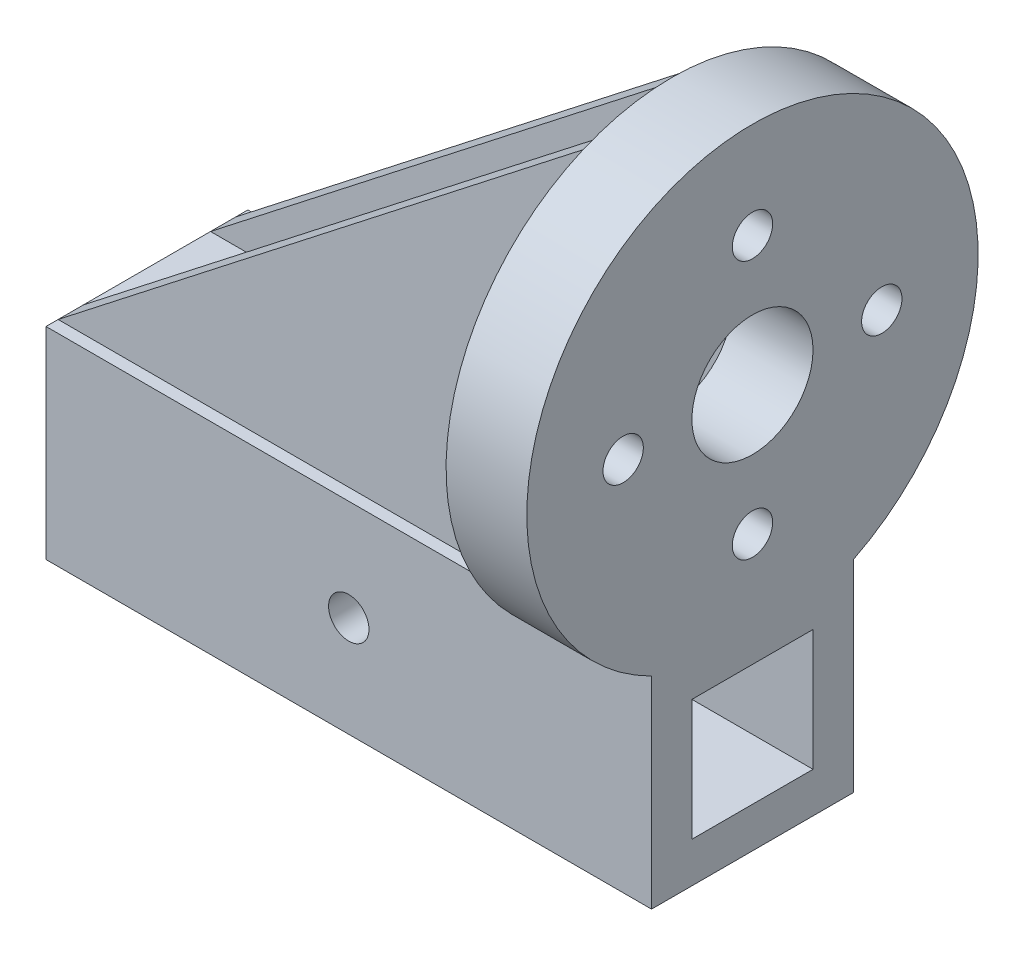
ISO-10303-21;
HEADER;
FILE_DESCRIPTION(('STEP AP214'),'2;1');
FILE_NAME('part.step','',(''),(''),'','','');
FILE_SCHEMA(('AUTOMOTIVE_DESIGN { 1 0 10303 214 1 1 1 1 }'));
ENDSEC;
DATA;
#1=APPLICATION_CONTEXT('core data for automotive mechanical design processes');
#2=APPLICATION_PROTOCOL_DEFINITION('international standard','automotive_design',2000,#1);
#3=PRODUCT_CONTEXT('',#1,'mechanical');
#4=PRODUCT('Part','Part','',(#3));
#5=PRODUCT_RELATED_PRODUCT_CATEGORY('part','',(#4));
#6=PRODUCT_DEFINITION_FORMATION('','',#4);
#7=PRODUCT_DEFINITION_CONTEXT('part definition',#1,'design');
#8=PRODUCT_DEFINITION('design','',#6,#7);
#9=PRODUCT_DEFINITION_SHAPE('','',#8);
#10=(LENGTH_UNIT() NAMED_UNIT(*) SI_UNIT(.MILLI.,.METRE.));
#11=(NAMED_UNIT(*) PLANE_ANGLE_UNIT() SI_UNIT($,.RADIAN.));
#12=(NAMED_UNIT(*) SI_UNIT($,.STERADIAN.) SOLID_ANGLE_UNIT());
#13=UNCERTAINTY_MEASURE_WITH_UNIT(LENGTH_MEASURE(1.E-05),#10,'distance_accuracy_value','');
#14=(GEOMETRIC_REPRESENTATION_CONTEXT(3) GLOBAL_UNCERTAINTY_ASSIGNED_CONTEXT((#13)) GLOBAL_UNIT_ASSIGNED_CONTEXT((#10,
#11,#12)) REPRESENTATION_CONTEXT('',''));
#15=CARTESIAN_POINT('',(0.,0.,0.));
#16=DIRECTION('',(0.,0.,1.));
#17=DIRECTION('',(1.,0.,0.));
#18=AXIS2_PLACEMENT_3D('',#15,#16,#17);
#19=CARTESIAN_POINT('',(0.,50.,0.));
#20=DIRECTION('',(0.,-1.,0.));
#21=DIRECTION('',(0.,0.,-1.));
#22=AXIS2_PLACEMENT_3D('',#19,#20,#21);
#23=PLANE('',#22);
#24=DIRECTION('',(-1.,0.,0.));
#25=VECTOR('',#24,1.);
#26=CARTESIAN_POINT('',(55.,50.,22.));
#27=LINE('',#26,#25);
#28=CARTESIAN_POINT('',(55.,50.,22.));
#29=VERTEX_POINT('',#28);
#30=CARTESIAN_POINT('',(-75.,50.,22.));
#31=VERTEX_POINT('',#30);
#32=EDGE_CURVE('E55',#29,#31,#27,.T.);
#33=ORIENTED_EDGE('',*,*,#32,.T.);
#34=DIRECTION('',(0.,0.,1.));
#35=VECTOR('',#34,1.);
#36=CARTESIAN_POINT('',(-75.,50.,25.));
#37=LINE('',#36,#35);
#38=CARTESIAN_POINT('',(-75.,50.,25.));
#39=VERTEX_POINT('',#38);
#40=EDGE_CURVE('E337',#31,#39,#37,.T.);
#41=ORIENTED_EDGE('',*,*,#40,.T.);
#42=DIRECTION('',(1.,0.,0.));
#43=VECTOR('',#42,1.);
#44=CARTESIAN_POINT('',(-75.,50.,25.));
#45=LINE('',#44,#43);
#46=CARTESIAN_POINT('',(55.,50.,25.));
#47=VERTEX_POINT('',#46);
#48=EDGE_CURVE('E345',#39,#47,#45,.T.);
#49=ORIENTED_EDGE('',*,*,#48,.T.);
#50=DIRECTION('',(0.,0.,1.));
#51=VECTOR('',#50,1.);
#52=CARTESIAN_POINT('',(55.,50.,0.));
#53=LINE('',#52,#51);
#54=EDGE_CURVE('E377',#29,#47,#53,.T.);
#55=ORIENTED_EDGE('',*,*,#54,.F.);
#56=EDGE_LOOP('',(#33,#41,#49,#55));
#57=FACE_BOUND('',#56,.T.);
#58=ADVANCED_FACE('F39',(#57),#23,.F.);
#59=CARTESIAN_POINT('',(55.,100.,0.));
#60=DIRECTION('',(1.,0.,0.));
#61=DIRECTION('',(0.,0.,-1.));
#62=AXIS2_PLACEMENT_3D('',#59,#60,#61);
#63=PLANE('',#62);
#64=CARTESIAN_POINT('',(55.,132.030384041713,0.));
#65=DIRECTION('',(1.,0.,0.));
#66=DIRECTION('',(0.,0.,-1.));
#67=AXIS2_PLACEMENT_3D('',#64,#65,#66);
#68=CIRCLE('',#67,5.);
#69=CARTESIAN_POINT('',(55.,132.030384041713,-5.00000000000001));
#70=VERTEX_POINT('',#69);
#71=EDGE_CURVE('E268',#70,#70,#68,.T.);
#72=ORIENTED_EDGE('',*,*,#71,.T.);
#73=EDGE_LOOP('',(#72));
#74=FACE_BOUND('',#73,.T.);
#75=CARTESIAN_POINT('',(55.,100.,0.));
#76=DIRECTION('',(1.,0.,0.));
#77=DIRECTION('',(0.,0.,-1.));
#78=AXIS2_PLACEMENT_3D('',#75,#76,#77);
#79=CIRCLE('',#78,15.);
#80=CARTESIAN_POINT('',(55.,100.,-15.));
#81=VERTEX_POINT('',#80);
#82=EDGE_CURVE('E252',#81,#81,#79,.T.);
#83=ORIENTED_EDGE('',*,*,#82,.T.);
#84=EDGE_LOOP('',(#83));
#85=FACE_BOUND('',#84,.T.);
#86=CARTESIAN_POINT('',(55.,67.9696159582867,-1.58993172471758E-12));
#87=DIRECTION('',(1.,0.,0.));
#88=DIRECTION('',(0.,0.,-1.));
#89=AXIS2_PLACEMENT_3D('',#86,#87,#88);
#90=CIRCLE('',#89,5.);
#91=CARTESIAN_POINT('',(55.,67.9696159582867,-5.00000000000159));
#92=VERTEX_POINT('',#91);
#93=EDGE_CURVE('E244',#92,#92,#90,.T.);
#94=ORIENTED_EDGE('',*,*,#93,.T.);
#95=EDGE_LOOP('',(#94));
#96=FACE_BOUND('',#95,.T.);
#97=DIRECTION('',(0.,0.,1.));
#98=VECTOR('',#97,1.);
#99=CARTESIAN_POINT('',(55.,151.408233922207,15.75));
#100=LINE('',#99,#98);
#101=CARTESIAN_POINT('',(55.,151.408233922207,15.75));
#102=VERTEX_POINT('',#101);
#103=CARTESIAN_POINT('',(55.,151.408233922207,21.9589044580928));
#104=VERTEX_POINT('',#103);
#105=EDGE_CURVE('E171',#102,#104,#100,.T.);
#106=ORIENTED_EDGE('',*,*,#105,.T.);
#107=CARTESIAN_POINT('',(55.,100.,0.));
#108=DIRECTION('',(1.,0.,0.));
#109=DIRECTION('',(0.,0.,-1.));
#110=AXIS2_PLACEMENT_3D('',#107,#108,#109);
#111=CIRCLE('',#110,55.9016994374948);
#112=CARTESIAN_POINT('',(55.,151.408233922207,-21.9589044580928));
#113=VERTEX_POINT('',#112);
#114=EDGE_CURVE('E433',#113,#104,#111,.T.);
#115=ORIENTED_EDGE('',*,*,#114,.F.);
#116=DIRECTION('',(0.,0.,-1.));
#117=VECTOR('',#116,1.);
#118=CARTESIAN_POINT('',(55.,151.408233922207,-15.75));
#119=LINE('',#118,#117);
#120=CARTESIAN_POINT('',(55.,151.408233922207,-15.75));
#121=VERTEX_POINT('',#120);
#122=EDGE_CURVE('E228',#121,#113,#119,.T.);
#123=ORIENTED_EDGE('',*,*,#122,.F.);
#124=DIRECTION('',(0.,-1.,0.));
#125=VECTOR('',#124,1.);
#126=CARTESIAN_POINT('',(55.,151.408233922207,-15.75));
#127=LINE('',#126,#125);
#128=CARTESIAN_POINT('',(55.,50.,-15.75));
#129=VERTEX_POINT('',#128);
#130=EDGE_CURVE('E214',#121,#129,#127,.T.);
#131=ORIENTED_EDGE('',*,*,#130,.T.);
#132=CARTESIAN_POINT('',(55.,50.,15.75));
#133=VERTEX_POINT('',#132);
#134=EDGE_CURVE('E381',#129,#133,#53,.T.);
#135=ORIENTED_EDGE('',*,*,#134,.T.);
#136=DIRECTION('',(0.,-1.,0.));
#137=VECTOR('',#136,1.);
#138=CARTESIAN_POINT('',(55.,151.408233922207,15.75));
#139=LINE('',#138,#137);
#140=EDGE_CURVE('E730',#102,#133,#139,.T.);
#141=ORIENTED_EDGE('',*,*,#140,.F.);
#142=EDGE_LOOP('',(#106,#115,#123,#131,#135,#141));
#143=FACE_BOUND('',#142,.T.);
#144=ADVANCED_FACE('F463',(#74,#85,#96,#143),#63,.F.);
#145=CARTESIAN_POINT('',(55.,99.9999999999994,32.0303840417124));
#146=DIRECTION('',(1.,0.,0.));
#147=DIRECTION('',(0.,0.,-1.));
#148=AXIS2_PLACEMENT_3D('',#145,#146,#147);
#149=CIRCLE('',#148,5.);
#150=CARTESIAN_POINT('',(55.,99.9999999999994,27.0303840417123));
#151=VERTEX_POINT('',#150);
#152=EDGE_CURVE('E236',#151,#151,#149,.T.);
#153=ORIENTED_EDGE('',*,*,#152,.T.);
#154=EDGE_LOOP('',(#153));
#155=FACE_BOUND('',#154,.T.);
#156=DIRECTION('',(0.,1.,0.));
#157=VECTOR('',#156,1.);
#158=CARTESIAN_POINT('',(55.,100.,22.));
#159=LINE('',#158,#157);
#160=CARTESIAN_POINT('',(55.,151.390660630118,22.));
#161=VERTEX_POINT('',#160);
#162=EDGE_CURVE('E11',#29,#161,#159,.T.);
#163=ORIENTED_EDGE('',*,*,#162,.F.);
#164=ORIENTED_EDGE('',*,*,#54,.T.);
#165=EDGE_CURVE('E282',#161,#47,#111,.T.);
#166=ORIENTED_EDGE('',*,*,#165,.F.);
#167=EDGE_LOOP('',(#163,#164,#166));
#168=FACE_BOUND('',#167,.T.);
#169=ADVANCED_FACE('F454',(#155,#168),#63,.F.);
#170=DIRECTION('',(-1.,0.,0.));
#171=VECTOR('',#170,1.);
#172=CARTESIAN_POINT('',(55.,50.,-22.));
#173=LINE('',#172,#171);
#174=CARTESIAN_POINT('',(55.,50.,-22.));
#175=VERTEX_POINT('',#174);
#176=CARTESIAN_POINT('',(-75.,50.,-22.));
#177=VERTEX_POINT('',#176);
#178=EDGE_CURVE('E205',#175,#177,#173,.T.);
#179=ORIENTED_EDGE('',*,*,#178,.F.);
#180=CARTESIAN_POINT('',(55.,50.,-25.));
#181=VERTEX_POINT('',#180);
#182=EDGE_CURVE('E378',#181,#175,#53,.T.);
#183=ORIENTED_EDGE('',*,*,#182,.F.);
#184=DIRECTION('',(-1.,0.,0.));
#185=VECTOR('',#184,1.);
#186=CARTESIAN_POINT('',(-75.,50.,-25.));
#187=LINE('',#186,#185);
#188=CARTESIAN_POINT('',(-75.,50.,-25.));
#189=VERTEX_POINT('',#188);
#190=EDGE_CURVE('E338',#181,#189,#187,.T.);
#191=ORIENTED_EDGE('',*,*,#190,.T.);
#192=EDGE_CURVE('E339',#189,#177,#37,.T.);
#193=ORIENTED_EDGE('',*,*,#192,.T.);
#194=EDGE_LOOP('',(#179,#183,#191,#193));
#195=FACE_BOUND('',#194,.T.);
#196=ADVANCED_FACE('F452',(#195),#23,.F.);
#197=CARTESIAN_POINT('',(55.,100.000000000001,-32.0303840417142));
#198=DIRECTION('',(1.,0.,0.));
#199=DIRECTION('',(0.,0.,-1.));
#200=AXIS2_PLACEMENT_3D('',#197,#198,#199);
#201=CIRCLE('',#200,5.);
#202=CARTESIAN_POINT('',(55.,100.000000000001,-37.0303840417142));
#203=VERTEX_POINT('',#202);
#204=EDGE_CURVE('E260',#203,#203,#201,.T.);
#205=ORIENTED_EDGE('',*,*,#204,.T.);
#206=EDGE_LOOP('',(#205));
#207=FACE_BOUND('',#206,.T.);
#208=DIRECTION('',(0.,-1.,0.));
#209=VECTOR('',#208,1.);
#210=CARTESIAN_POINT('',(55.,100.,-22.));
#211=LINE('',#210,#209);
#212=CARTESIAN_POINT('',(55.,151.390660630118,-22.));
#213=VERTEX_POINT('',#212);
#214=EDGE_CURVE('E48',#213,#175,#211,.T.);
#215=ORIENTED_EDGE('',*,*,#214,.F.);
#216=EDGE_CURVE('E276',#181,#213,#111,.T.);
#217=ORIENTED_EDGE('',*,*,#216,.F.);
#218=ORIENTED_EDGE('',*,*,#182,.T.);
#219=EDGE_LOOP('',(#215,#217,#218));
#220=FACE_BOUND('',#219,.T.);
#221=ADVANCED_FACE('F450',(#207,#220),#63,.F.);
#222=CARTESIAN_POINT('',(-75.,50.,-15.75));
#223=VERTEX_POINT('',#222);
#224=CARTESIAN_POINT('',(-75.,50.,15.75));
#225=VERTEX_POINT('',#224);
#226=EDGE_CURVE('E344',#223,#225,#37,.T.);
#227=ORIENTED_EDGE('',*,*,#226,.T.);
#228=DIRECTION('',(-1.,0.,0.));
#229=VECTOR('',#228,1.);
#230=CARTESIAN_POINT('',(55.,50.,15.75));
#231=LINE('',#230,#229);
#232=EDGE_CURVE('E180',#133,#225,#231,.T.);
#233=ORIENTED_EDGE('',*,*,#232,.F.);
#234=ORIENTED_EDGE('',*,*,#134,.F.);
#235=DIRECTION('',(-1.,0.,0.));
#236=VECTOR('',#235,1.);
#237=CARTESIAN_POINT('',(55.,50.,-15.75));
#238=LINE('',#237,#236);
#239=EDGE_CURVE('E206',#129,#223,#238,.T.);
#240=ORIENTED_EDGE('',*,*,#239,.T.);
#241=EDGE_LOOP('',(#227,#233,#234,#240));
#242=FACE_BOUND('',#241,.T.);
#243=ADVANCED_FACE('F456',(#242),#23,.F.);
#244=CARTESIAN_POINT('',(75.,50.,25.));
#245=DIRECTION('',(-1.,0.,0.));
#246=DIRECTION('',(0.,0.,1.));
#247=AXIS2_PLACEMENT_3D('',#244,#245,#246);
#248=PLANE('',#247);
#249=DIRECTION('',(0.,0.,1.));
#250=VECTOR('',#249,1.);
#251=CARTESIAN_POINT('',(75.,10.,25.));
#252=LINE('',#251,#250);
#253=CARTESIAN_POINT('',(75.,10.,-15.));
#254=VERTEX_POINT('',#253);
#255=CARTESIAN_POINT('',(75.,10.,15.));
#256=VERTEX_POINT('',#255);
#257=EDGE_CURVE('E306',#254,#256,#252,.T.);
#258=ORIENTED_EDGE('',*,*,#257,.T.);
#259=DIRECTION('',(0.,1.,0.));
#260=VECTOR('',#259,1.);
#261=CARTESIAN_POINT('',(75.,50.,15.));
#262=LINE('',#261,#260);
#263=CARTESIAN_POINT('',(75.,40.,15.));
#264=VERTEX_POINT('',#263);
#265=EDGE_CURVE('E328',#256,#264,#262,.T.);
#266=ORIENTED_EDGE('',*,*,#265,.T.);
#267=DIRECTION('',(0.,0.,-1.));
#268=VECTOR('',#267,1.);
#269=CARTESIAN_POINT('',(75.,40.,25.));
#270=LINE('',#269,#268);
#271=CARTESIAN_POINT('',(75.,40.,-15.));
#272=VERTEX_POINT('',#271);
#273=EDGE_CURVE('E324',#264,#272,#270,.T.);
#274=ORIENTED_EDGE('',*,*,#273,.T.);
#275=DIRECTION('',(0.,-1.,0.));
#276=VECTOR('',#275,1.);
#277=CARTESIAN_POINT('',(75.,50.,-15.));
#278=LINE('',#277,#276);
#279=EDGE_CURVE('E320',#272,#254,#278,.T.);
#280=ORIENTED_EDGE('',*,*,#279,.T.);
#281=EDGE_LOOP('',(#258,#266,#274,#280));
#282=FACE_BOUND('',#281,.T.);
#283=DIRECTION('',(0.,-1.,0.));
#284=VECTOR('',#283,1.);
#285=CARTESIAN_POINT('',(75.,50.,-25.));
#286=LINE('',#285,#284);
#287=CARTESIAN_POINT('',(75.,50.,-25.));
#288=VERTEX_POINT('',#287);
#289=CARTESIAN_POINT('',(75.,0.,-25.));
#290=VERTEX_POINT('',#289);
#291=EDGE_CURVE('E373',#288,#290,#286,.T.);
#292=ORIENTED_EDGE('',*,*,#291,.F.);
#293=CARTESIAN_POINT('',(75.,100.,0.));
#294=DIRECTION('',(1.,0.,0.));
#295=DIRECTION('',(0.,0.,-1.));
#296=AXIS2_PLACEMENT_3D('',#293,#294,#295);
#297=CIRCLE('',#296,55.9016994374948);
#298=CARTESIAN_POINT('',(75.,50.,25.));
#299=VERTEX_POINT('',#298);
#300=EDGE_CURVE('E272',#288,#299,#297,.T.);
#301=ORIENTED_EDGE('',*,*,#300,.T.);
#302=DIRECTION('',(0.,-1.,0.));
#303=VECTOR('',#302,1.);
#304=CARTESIAN_POINT('',(75.,50.,25.));
#305=LINE('',#304,#303);
#306=CARTESIAN_POINT('',(75.,0.,25.));
#307=VERTEX_POINT('',#306);
#308=EDGE_CURVE('E349',#299,#307,#305,.T.);
#309=ORIENTED_EDGE('',*,*,#308,.T.);
#310=DIRECTION('',(0.,0.,-1.));
#311=VECTOR('',#310,1.);
#312=CARTESIAN_POINT('',(75.,0.,25.));
#313=LINE('',#312,#311);
#314=EDGE_CURVE('E332',#307,#290,#313,.T.);
#315=ORIENTED_EDGE('',*,*,#314,.T.);
#316=EDGE_LOOP('',(#292,#301,#309,#315));
#317=FACE_BOUND('',#316,.T.);
#318=CARTESIAN_POINT('',(75.,132.030384041713,0.));
#319=DIRECTION('',(1.,0.,0.));
#320=DIRECTION('',(0.,0.,-1.));
#321=AXIS2_PLACEMENT_3D('',#318,#319,#320);
#322=CIRCLE('',#321,5.);
#323=CARTESIAN_POINT('',(75.,132.030384041713,-5.00000000000001));
#324=VERTEX_POINT('',#323);
#325=EDGE_CURVE('E264',#324,#324,#322,.T.);
#326=ORIENTED_EDGE('',*,*,#325,.F.);
#327=EDGE_LOOP('',(#326));
#328=FACE_BOUND('',#327,.T.);
#329=CARTESIAN_POINT('',(75.,100.000000000001,-32.0303840417142));
#330=DIRECTION('',(1.,0.,0.));
#331=DIRECTION('',(0.,0.,-1.));
#332=AXIS2_PLACEMENT_3D('',#329,#330,#331);
#333=CIRCLE('',#332,5.);
#334=CARTESIAN_POINT('',(75.,100.000000000001,-37.0303840417142));
#335=VERTEX_POINT('',#334);
#336=EDGE_CURVE('E256',#335,#335,#333,.T.);
#337=ORIENTED_EDGE('',*,*,#336,.F.);
#338=EDGE_LOOP('',(#337));
#339=FACE_BOUND('',#338,.T.);
#340=CARTESIAN_POINT('',(75.,100.,0.));
#341=DIRECTION('',(1.,0.,0.));
#342=DIRECTION('',(0.,0.,-1.));
#343=AXIS2_PLACEMENT_3D('',#340,#341,#342);
#344=CIRCLE('',#343,15.);
#345=CARTESIAN_POINT('',(75.,100.,-15.));
#346=VERTEX_POINT('',#345);
#347=EDGE_CURVE('E248',#346,#346,#344,.T.);
#348=ORIENTED_EDGE('',*,*,#347,.F.);
#349=EDGE_LOOP('',(#348));
#350=FACE_BOUND('',#349,.T.);
#351=CARTESIAN_POINT('',(75.,67.9696159582867,-1.58993172471758E-12));
#352=DIRECTION('',(1.,0.,0.));
#353=DIRECTION('',(0.,0.,-1.));
#354=AXIS2_PLACEMENT_3D('',#351,#352,#353);
#355=CIRCLE('',#354,5.);
#356=CARTESIAN_POINT('',(75.,67.9696159582867,-5.00000000000159));
#357=VERTEX_POINT('',#356);
#358=EDGE_CURVE('E240',#357,#357,#355,.T.);
#359=ORIENTED_EDGE('',*,*,#358,.F.);
#360=EDGE_LOOP('',(#359));
#361=FACE_BOUND('',#360,.T.);
#362=CARTESIAN_POINT('',(75.,99.9999999999994,32.0303840417124));
#363=DIRECTION('',(1.,0.,0.));
#364=DIRECTION('',(0.,0.,-1.));
#365=AXIS2_PLACEMENT_3D('',#362,#363,#364);
#366=CIRCLE('',#365,5.);
#367=CARTESIAN_POINT('',(75.,99.9999999999994,27.0303840417123));
#368=VERTEX_POINT('',#367);
#369=EDGE_CURVE('E232',#368,#368,#366,.T.);
#370=ORIENTED_EDGE('',*,*,#369,.F.);
#371=EDGE_LOOP('',(#370));
#372=FACE_BOUND('',#371,.T.);
#373=ADVANCED_FACE('F41',(#282,#317,#328,#339,#350,#361,#372),#248,.F.);
#374=CARTESIAN_POINT('',(-75.,50.,-25.));
#375=DIRECTION('',(0.,0.,1.));
#376=DIRECTION('',(1.,0.,0.));
#377=AXIS2_PLACEMENT_3D('',#374,#375,#376);
#378=PLANE('',#377);
#379=CARTESIAN_POINT('',(0.,25.,-25.));
#380=DIRECTION('',(0.,0.,1.));
#381=DIRECTION('',(1.,0.,0.));
#382=AXIS2_PLACEMENT_3D('',#379,#380,#381);
#383=CIRCLE('',#382,5.);
#384=CARTESIAN_POINT('',(5.,25.,-25.));
#385=VERTEX_POINT('',#384);
#386=EDGE_CURVE('E201',#385,#385,#383,.T.);
#387=ORIENTED_EDGE('',*,*,#386,.T.);
#388=EDGE_LOOP('',(#387));
#389=FACE_BOUND('',#388,.T.);
#390=DIRECTION('',(-1.,0.,0.));
#391=VECTOR('',#390,1.);
#392=CARTESIAN_POINT('',(-75.,0.,-25.));
#393=LINE('',#392,#391);
#394=CARTESIAN_POINT('',(-75.,0.,-25.));
#395=VERTEX_POINT('',#394);
#396=EDGE_CURVE('E353',#290,#395,#393,.T.);
#397=ORIENTED_EDGE('',*,*,#396,.T.);
#398=DIRECTION('',(0.,-1.,0.));
#399=VECTOR('',#398,1.);
#400=CARTESIAN_POINT('',(-75.,50.,-25.));
#401=LINE('',#400,#399);
#402=EDGE_CURVE('E369',#189,#395,#401,.T.);
#403=ORIENTED_EDGE('',*,*,#402,.F.);
#404=ORIENTED_EDGE('',*,*,#190,.F.);
#405=EDGE_CURVE('E333',#288,#181,#187,.T.);
#406=ORIENTED_EDGE('',*,*,#405,.F.);
#407=ORIENTED_EDGE('',*,*,#291,.T.);
#408=EDGE_LOOP('',(#397,#403,#404,#406,#407));
#409=FACE_BOUND('',#408,.T.);
#410=ADVANCED_FACE('F399',(#389,#409),#378,.F.);
#411=CARTESIAN_POINT('',(-75.,50.,25.));
#412=DIRECTION('',(1.,0.,0.));
#413=DIRECTION('',(0.,0.,-1.));
#414=AXIS2_PLACEMENT_3D('',#411,#412,#413);
#415=PLANE('',#414);
#416=DIRECTION('',(0.,0.,1.));
#417=VECTOR('',#416,1.);
#418=CARTESIAN_POINT('',(-75.,40.,-15.));
#419=LINE('',#418,#417);
#420=CARTESIAN_POINT('',(-75.,40.,-15.));
#421=VERTEX_POINT('',#420);
#422=CARTESIAN_POINT('',(-75.,40.,15.));
#423=VERTEX_POINT('',#422);
#424=EDGE_CURVE('E297',#421,#423,#419,.T.);
#425=ORIENTED_EDGE('',*,*,#424,.T.);
#426=DIRECTION('',(0.,-1.,0.));
#427=VECTOR('',#426,1.);
#428=CARTESIAN_POINT('',(-75.,40.,15.));
#429=LINE('',#428,#427);
#430=CARTESIAN_POINT('',(-75.,10.,15.));
#431=VERTEX_POINT('',#430);
#432=EDGE_CURVE('E280',#423,#431,#429,.T.);
#433=ORIENTED_EDGE('',*,*,#432,.T.);
#434=DIRECTION('',(0.,0.,-1.));
#435=VECTOR('',#434,1.);
#436=CARTESIAN_POINT('',(-75.,10.,15.));
#437=LINE('',#436,#435);
#438=CARTESIAN_POINT('',(-75.,10.,-15.));
#439=VERTEX_POINT('',#438);
#440=EDGE_CURVE('E289',#431,#439,#437,.T.);
#441=ORIENTED_EDGE('',*,*,#440,.T.);
#442=DIRECTION('',(0.,1.,0.));
#443=VECTOR('',#442,1.);
#444=CARTESIAN_POINT('',(-75.,10.,-15.));
#445=LINE('',#444,#443);
#446=EDGE_CURVE('E293',#439,#421,#445,.T.);
#447=ORIENTED_EDGE('',*,*,#446,.T.);
#448=EDGE_LOOP('',(#425,#433,#441,#447));
#449=FACE_BOUND('',#448,.T.);
#450=DIRECTION('',(0.,0.,1.));
#451=VECTOR('',#450,1.);
#452=CARTESIAN_POINT('',(-75.,0.,25.));
#453=LINE('',#452,#451);
#454=CARTESIAN_POINT('',(-75.,0.,25.));
#455=VERTEX_POINT('',#454);
#456=EDGE_CURVE('E356',#395,#455,#453,.T.);
#457=ORIENTED_EDGE('',*,*,#456,.T.);
#458=DIRECTION('',(0.,-1.,0.));
#459=VECTOR('',#458,1.);
#460=CARTESIAN_POINT('',(-75.,50.,25.));
#461=LINE('',#460,#459);
#462=EDGE_CURVE('E365',#39,#455,#461,.T.);
#463=ORIENTED_EDGE('',*,*,#462,.F.);
#464=ORIENTED_EDGE('',*,*,#40,.F.);
#465=DIRECTION('',(0.,0.,1.));
#466=VECTOR('',#465,1.);
#467=CARTESIAN_POINT('',(-75.,50.,15.75));
#468=LINE('',#467,#466);
#469=EDGE_CURVE('E62',#225,#31,#468,.T.);
#470=ORIENTED_EDGE('',*,*,#469,.F.);
#471=ORIENTED_EDGE('',*,*,#226,.F.);
#472=DIRECTION('',(0.,0.,-1.));
#473=VECTOR('',#472,1.);
#474=CARTESIAN_POINT('',(-75.,50.,-15.75));
#475=LINE('',#474,#473);
#476=EDGE_CURVE('E217',#223,#177,#475,.T.);
#477=ORIENTED_EDGE('',*,*,#476,.T.);
#478=ORIENTED_EDGE('',*,*,#192,.F.);
#479=ORIENTED_EDGE('',*,*,#402,.T.);
#480=EDGE_LOOP('',(#457,#463,#464,#470,#471,#477,#478,#479));
#481=FACE_BOUND('',#480,.T.);
#482=ADVANCED_FACE('F402',(#449,#481),#415,.F.);
#483=CARTESIAN_POINT('',(-75.,50.,25.));
#484=DIRECTION('',(0.,0.,-1.));
#485=DIRECTION('',(-1.,0.,0.));
#486=AXIS2_PLACEMENT_3D('',#483,#484,#485);
#487=PLANE('',#486);
#488=CARTESIAN_POINT('',(0.,25.,25.));
#489=DIRECTION('',(0.,0.,-1.));
#490=DIRECTION('',(-1.,0.,0.));
#491=AXIS2_PLACEMENT_3D('',#488,#489,#490);
#492=CIRCLE('',#491,5.);
#493=CARTESIAN_POINT('',(-5.,25.,25.));
#494=VERTEX_POINT('',#493);
#495=EDGE_CURVE('E197',#494,#494,#492,.T.);
#496=ORIENTED_EDGE('',*,*,#495,.T.);
#497=EDGE_LOOP('',(#496));
#498=FACE_BOUND('',#497,.T.);
#499=DIRECTION('',(1.,0.,0.));
#500=VECTOR('',#499,1.);
#501=CARTESIAN_POINT('',(-75.,0.,25.));
#502=LINE('',#501,#500);
#503=EDGE_CURVE('E359',#455,#307,#502,.T.);
#504=ORIENTED_EDGE('',*,*,#503,.T.);
#505=ORIENTED_EDGE('',*,*,#308,.F.);
#506=EDGE_CURVE('E343',#47,#299,#45,.T.);
#507=ORIENTED_EDGE('',*,*,#506,.F.);
#508=ORIENTED_EDGE('',*,*,#48,.F.);
#509=ORIENTED_EDGE('',*,*,#462,.T.);
#510=EDGE_LOOP('',(#504,#505,#507,#508,#509));
#511=FACE_BOUND('',#510,.T.);
#512=ADVANCED_FACE('F414',(#498,#511),#487,.F.);
#513=CARTESIAN_POINT('',(0.,0.,0.));
#514=DIRECTION('',(0.,-1.,0.));
#515=DIRECTION('',(0.,0.,-1.));
#516=AXIS2_PLACEMENT_3D('',#513,#514,#515);
#517=PLANE('',#516);
#518=ORIENTED_EDGE('',*,*,#314,.F.);
#519=ORIENTED_EDGE('',*,*,#503,.F.);
#520=ORIENTED_EDGE('',*,*,#456,.F.);
#521=ORIENTED_EDGE('',*,*,#396,.F.);
#522=EDGE_LOOP('',(#518,#519,#520,#521));
#523=FACE_BOUND('',#522,.T.);
#524=ADVANCED_FACE('F412',(#523),#517,.T.);
#525=CARTESIAN_POINT('',(-75.,40.,15.));
#526=DIRECTION('',(0.,0.,1.));
#527=DIRECTION('',(1.,0.,0.));
#528=AXIS2_PLACEMENT_3D('',#525,#526,#527);
#529=PLANE('',#528);
#530=CARTESIAN_POINT('',(0.,25.,15.));
#531=DIRECTION('',(0.,0.,1.));
#532=DIRECTION('',(1.,0.,0.));
#533=AXIS2_PLACEMENT_3D('',#530,#531,#532);
#534=CIRCLE('',#533,5.);
#535=CARTESIAN_POINT('',(5.,25.,15.));
#536=VERTEX_POINT('',#535);
#537=EDGE_CURVE('E193',#536,#536,#534,.T.);
#538=ORIENTED_EDGE('',*,*,#537,.T.);
#539=EDGE_LOOP('',(#538));
#540=FACE_BOUND('',#539,.T.);
#541=DIRECTION('',(1.,0.,0.));
#542=VECTOR('',#541,1.);
#543=CARTESIAN_POINT('',(-75.,10.,15.));
#544=LINE('',#543,#542);
#545=EDGE_CURVE('E301',#431,#256,#544,.T.);
#546=ORIENTED_EDGE('',*,*,#545,.F.);
#547=ORIENTED_EDGE('',*,*,#432,.F.);
#548=DIRECTION('',(1.,0.,0.));
#549=VECTOR('',#548,1.);
#550=CARTESIAN_POINT('',(-75.,40.,15.));
#551=LINE('',#550,#549);
#552=EDGE_CURVE('E302',#423,#264,#551,.T.);
#553=ORIENTED_EDGE('',*,*,#552,.T.);
#554=ORIENTED_EDGE('',*,*,#265,.F.);
#555=EDGE_LOOP('',(#546,#547,#553,#554));
#556=FACE_BOUND('',#555,.T.);
#557=ADVANCED_FACE('F487',(#540,#556),#529,.F.);
#558=CARTESIAN_POINT('',(-75.,40.,-15.));
#559=DIRECTION('',(0.,1.,0.));
#560=DIRECTION('',(0.,0.,1.));
#561=AXIS2_PLACEMENT_3D('',#558,#559,#560);
#562=PLANE('',#561);
#563=ORIENTED_EDGE('',*,*,#552,.F.);
#564=ORIENTED_EDGE('',*,*,#424,.F.);
#565=DIRECTION('',(1.,0.,0.));
#566=VECTOR('',#565,1.);
#567=CARTESIAN_POINT('',(-75.,40.,-15.));
#568=LINE('',#567,#566);
#569=EDGE_CURVE('E307',#421,#272,#568,.T.);
#570=ORIENTED_EDGE('',*,*,#569,.T.);
#571=ORIENTED_EDGE('',*,*,#273,.F.);
#572=EDGE_LOOP('',(#563,#564,#570,#571));
#573=FACE_BOUND('',#572,.T.);
#574=ADVANCED_FACE('F484',(#573),#562,.F.);
#575=CARTESIAN_POINT('',(-75.,10.,-15.));
#576=DIRECTION('',(0.,0.,-1.));
#577=DIRECTION('',(-1.,0.,0.));
#578=AXIS2_PLACEMENT_3D('',#575,#576,#577);
#579=PLANE('',#578);
#580=CARTESIAN_POINT('',(0.,25.,-15.));
#581=DIRECTION('',(0.,0.,-1.));
#582=DIRECTION('',(-1.,0.,0.));
#583=AXIS2_PLACEMENT_3D('',#580,#581,#582);
#584=CIRCLE('',#583,5.);
#585=CARTESIAN_POINT('',(-5.,25.,-15.));
#586=VERTEX_POINT('',#585);
#587=EDGE_CURVE('E190',#586,#586,#584,.T.);
#588=ORIENTED_EDGE('',*,*,#587,.T.);
#589=EDGE_LOOP('',(#588));
#590=FACE_BOUND('',#589,.T.);
#591=ORIENTED_EDGE('',*,*,#569,.F.);
#592=ORIENTED_EDGE('',*,*,#446,.F.);
#593=DIRECTION('',(1.,0.,0.));
#594=VECTOR('',#593,1.);
#595=CARTESIAN_POINT('',(-75.,10.,-15.));
#596=LINE('',#595,#594);
#597=EDGE_CURVE('E311',#439,#254,#596,.T.);
#598=ORIENTED_EDGE('',*,*,#597,.T.);
#599=ORIENTED_EDGE('',*,*,#279,.F.);
#600=EDGE_LOOP('',(#591,#592,#598,#599));
#601=FACE_BOUND('',#600,.T.);
#602=ADVANCED_FACE('F388',(#590,#601),#579,.F.);
#603=CARTESIAN_POINT('',(-75.,10.,15.));
#604=DIRECTION('',(0.,-1.,0.));
#605=DIRECTION('',(0.,0.,-1.));
#606=AXIS2_PLACEMENT_3D('',#603,#604,#605);
#607=PLANE('',#606);
#608=ORIENTED_EDGE('',*,*,#597,.F.);
#609=ORIENTED_EDGE('',*,*,#440,.F.);
#610=ORIENTED_EDGE('',*,*,#545,.T.);
#611=ORIENTED_EDGE('',*,*,#257,.F.);
#612=EDGE_LOOP('',(#608,#609,#610,#611));
#613=FACE_BOUND('',#612,.T.);
#614=ADVANCED_FACE('F483',(#613),#607,.F.);
#615=CARTESIAN_POINT('',(55.,100.,0.));
#616=DIRECTION('',(1.,0.,0.));
#617=DIRECTION('',(0.,0.,-1.));
#618=AXIS2_PLACEMENT_3D('',#615,#616,#617);
#619=CYLINDRICAL_SURFACE('',#618,55.9016994374948);
#620=ORIENTED_EDGE('',*,*,#405,.T.);
#621=ORIENTED_EDGE('',*,*,#216,.T.);
#622=EDGE_CURVE('E281',#213,#113,#111,.T.);
#623=ORIENTED_EDGE('',*,*,#622,.T.);
#624=ORIENTED_EDGE('',*,*,#114,.T.);
#625=EDGE_CURVE('E167',#104,#161,#111,.T.);
#626=ORIENTED_EDGE('',*,*,#625,.T.);
#627=ORIENTED_EDGE('',*,*,#165,.T.);
#628=ORIENTED_EDGE('',*,*,#506,.T.);
#629=ORIENTED_EDGE('',*,*,#300,.F.);
#630=EDGE_LOOP('',(#620,#621,#623,#624,#626,#627,#628,#629));
#631=FACE_BOUND('',#630,.T.);
#632=ADVANCED_FACE('F422',(#631),#619,.T.);
#633=CARTESIAN_POINT('',(55.,132.030384041713,0.));
#634=DIRECTION('',(1.,0.,0.));
#635=DIRECTION('',(0.,0.,-1.));
#636=AXIS2_PLACEMENT_3D('',#633,#634,#635);
#637=CYLINDRICAL_SURFACE('',#636,5.);
#638=ORIENTED_EDGE('',*,*,#71,.F.);
#639=EDGE_LOOP('',(#638));
#640=FACE_BOUND('',#639,.T.);
#641=ORIENTED_EDGE('',*,*,#325,.T.);
#642=EDGE_LOOP('',(#641));
#643=FACE_BOUND('',#642,.T.);
#644=ADVANCED_FACE('F479',(#640,#643),#637,.F.);
#645=CARTESIAN_POINT('',(55.,100.000000000001,-32.0303840417142));
#646=DIRECTION('',(1.,0.,0.));
#647=DIRECTION('',(0.,0.,-1.));
#648=AXIS2_PLACEMENT_3D('',#645,#646,#647);
#649=CYLINDRICAL_SURFACE('',#648,5.);
#650=ORIENTED_EDGE('',*,*,#204,.F.);
#651=EDGE_LOOP('',(#650));
#652=FACE_BOUND('',#651,.T.);
#653=ORIENTED_EDGE('',*,*,#336,.T.);
#654=EDGE_LOOP('',(#653));
#655=FACE_BOUND('',#654,.T.);
#656=ADVANCED_FACE('F564',(#652,#655),#649,.F.);
#657=CARTESIAN_POINT('',(55.,100.,0.));
#658=DIRECTION('',(1.,0.,0.));
#659=DIRECTION('',(0.,0.,-1.));
#660=AXIS2_PLACEMENT_3D('',#657,#658,#659);
#661=CYLINDRICAL_SURFACE('',#660,15.);
#662=ORIENTED_EDGE('',*,*,#82,.F.);
#663=EDGE_LOOP('',(#662));
#664=FACE_BOUND('',#663,.T.);
#665=ORIENTED_EDGE('',*,*,#347,.T.);
#666=EDGE_LOOP('',(#665));
#667=FACE_BOUND('',#666,.T.);
#668=ADVANCED_FACE('F571',(#664,#667),#661,.F.);
#669=CARTESIAN_POINT('',(55.,67.9696159582867,-1.58993172471758E-12));
#670=DIRECTION('',(1.,0.,0.));
#671=DIRECTION('',(0.,0.,-1.));
#672=AXIS2_PLACEMENT_3D('',#669,#670,#671);
#673=CYLINDRICAL_SURFACE('',#672,5.);
#674=ORIENTED_EDGE('',*,*,#93,.F.);
#675=EDGE_LOOP('',(#674));
#676=FACE_BOUND('',#675,.T.);
#677=ORIENTED_EDGE('',*,*,#358,.T.);
#678=EDGE_LOOP('',(#677));
#679=FACE_BOUND('',#678,.T.);
#680=ADVANCED_FACE('F578',(#676,#679),#673,.F.);
#681=CARTESIAN_POINT('',(55.,99.9999999999994,32.0303840417124));
#682=DIRECTION('',(1.,0.,0.));
#683=DIRECTION('',(0.,0.,-1.));
#684=AXIS2_PLACEMENT_3D('',#681,#682,#683);
#685=CYLINDRICAL_SURFACE('',#684,5.);
#686=ORIENTED_EDGE('',*,*,#152,.F.);
#687=EDGE_LOOP('',(#686));
#688=FACE_BOUND('',#687,.T.);
#689=ORIENTED_EDGE('',*,*,#369,.T.);
#690=EDGE_LOOP('',(#689));
#691=FACE_BOUND('',#690,.T.);
#692=ADVANCED_FACE('F586',(#688,#691),#685,.F.);
#693=CARTESIAN_POINT('',(55.,151.408233922207,-15.75));
#694=DIRECTION('',(1.,0.,0.));
#695=DIRECTION('',(0.,0.,-1.));
#696=AXIS2_PLACEMENT_3D('',#693,#694,#695);
#697=PLANE('',#696);
#698=CARTESIAN_POINT('',(55.,151.408233922207,-22.));
#699=VERTEX_POINT('',#698);
#700=EDGE_CURVE('E233',#113,#699,#119,.T.);
#701=ORIENTED_EDGE('',*,*,#700,.F.);
#702=ORIENTED_EDGE('',*,*,#622,.F.);
#703=DIRECTION('',(0.,-1.,0.));
#704=VECTOR('',#703,1.);
#705=CARTESIAN_POINT('',(55.,151.408233922207,-22.));
#706=LINE('',#705,#704);
#707=EDGE_CURVE('E210',#699,#213,#706,.T.);
#708=ORIENTED_EDGE('',*,*,#707,.F.);
#709=EDGE_LOOP('',(#701,#702,#708));
#710=FACE_BOUND('',#709,.T.);
#711=ADVANCED_FACE('F448',(#710),#697,.T.);
#712=CARTESIAN_POINT('',(-75.,50.,-15.75));
#713=DIRECTION('',(-0.615062848028723,0.788478086553327,0.));
#714=DIRECTION('',(-0.788478086553327,-0.615062848028723,0.));
#715=AXIS2_PLACEMENT_3D('',#712,#713,#714);
#716=PLANE('',#715);
#717=DIRECTION('',(0.788478086553327,0.615062848028723,0.));
#718=VECTOR('',#717,1.);
#719=CARTESIAN_POINT('',(-75.,50.,-22.));
#720=LINE('',#719,#718);
#721=EDGE_CURVE('E221',#177,#699,#720,.T.);
#722=ORIENTED_EDGE('',*,*,#721,.F.);
#723=ORIENTED_EDGE('',*,*,#476,.F.);
#724=DIRECTION('',(0.788478086553327,0.615062848028723,0.));
#725=VECTOR('',#724,1.);
#726=CARTESIAN_POINT('',(-75.,50.,-15.75));
#727=LINE('',#726,#725);
#728=EDGE_CURVE('E209',#223,#121,#727,.T.);
#729=ORIENTED_EDGE('',*,*,#728,.T.);
#730=ORIENTED_EDGE('',*,*,#122,.T.);
#731=ORIENTED_EDGE('',*,*,#700,.T.);
#732=EDGE_LOOP('',(#722,#723,#729,#730,#731));
#733=FACE_BOUND('',#732,.T.);
#734=ADVANCED_FACE('F441',(#733),#716,.T.);
#735=CARTESIAN_POINT('',(0.,0.,-15.75));
#736=DIRECTION('',(0.,0.,1.));
#737=DIRECTION('',(1.,0.,0.));
#738=AXIS2_PLACEMENT_3D('',#735,#736,#737);
#739=PLANE('',#738);
#740=ORIENTED_EDGE('',*,*,#239,.F.);
#741=ORIENTED_EDGE('',*,*,#130,.F.);
#742=ORIENTED_EDGE('',*,*,#728,.F.);
#743=EDGE_LOOP('',(#740,#741,#742));
#744=FACE_BOUND('',#743,.T.);
#745=ADVANCED_FACE('F608',(#744),#739,.T.);
#746=CARTESIAN_POINT('',(0.,0.,-22.));
#747=DIRECTION('',(0.,0.,1.));
#748=DIRECTION('',(1.,0.,0.));
#749=AXIS2_PLACEMENT_3D('',#746,#747,#748);
#750=PLANE('',#749);
#751=ORIENTED_EDGE('',*,*,#178,.T.);
#752=ORIENTED_EDGE('',*,*,#721,.T.);
#753=ORIENTED_EDGE('',*,*,#707,.T.);
#754=ORIENTED_EDGE('',*,*,#214,.T.);
#755=EDGE_LOOP('',(#751,#752,#753,#754));
#756=FACE_BOUND('',#755,.T.);
#757=ADVANCED_FACE('F395',(#756),#750,.F.);
#758=CARTESIAN_POINT('',(0.,25.,-55.9016994374948));
#759=DIRECTION('',(0.,0.,1.));
#760=DIRECTION('',(1.,0.,0.));
#761=AXIS2_PLACEMENT_3D('',#758,#759,#760);
#762=CYLINDRICAL_SURFACE('',#761,5.);
#763=ORIENTED_EDGE('',*,*,#587,.F.);
#764=EDGE_LOOP('',(#763));
#765=FACE_BOUND('',#764,.T.);
#766=ORIENTED_EDGE('',*,*,#386,.F.);
#767=EDGE_LOOP('',(#766));
#768=FACE_BOUND('',#767,.T.);
#769=ADVANCED_FACE('F391',(#765,#768),#762,.F.);
#770=ORIENTED_EDGE('',*,*,#537,.F.);
#771=EDGE_LOOP('',(#770));
#772=FACE_BOUND('',#771,.T.);
#773=ORIENTED_EDGE('',*,*,#495,.F.);
#774=EDGE_LOOP('',(#773));
#775=FACE_BOUND('',#774,.T.);
#776=ADVANCED_FACE('F394',(#772,#775),#762,.F.);
#777=CARTESIAN_POINT('',(-75.,50.,15.75));
#778=DIRECTION('',(0.615062848028723,-0.788478086553327,0.));
#779=DIRECTION('',(0.788478086553327,0.615062848028723,0.));
#780=AXIS2_PLACEMENT_3D('',#777,#778,#779);
#781=PLANE('',#780);
#782=DIRECTION('',(0.788478086553327,0.615062848028723,0.));
#783=VECTOR('',#782,1.);
#784=CARTESIAN_POINT('',(-75.,50.,22.));
#785=LINE('',#784,#783);
#786=CARTESIAN_POINT('',(55.,151.408233922207,22.));
#787=VERTEX_POINT('',#786);
#788=EDGE_CURVE('E175',#31,#787,#785,.T.);
#789=ORIENTED_EDGE('',*,*,#788,.T.);
#790=EDGE_CURVE('E162',#104,#787,#100,.T.);
#791=ORIENTED_EDGE('',*,*,#790,.F.);
#792=ORIENTED_EDGE('',*,*,#105,.F.);
#793=DIRECTION('',(0.788478086553327,0.615062848028723,0.));
#794=VECTOR('',#793,1.);
#795=CARTESIAN_POINT('',(-75.,50.,15.75));
#796=LINE('',#795,#794);
#797=EDGE_CURVE('E172',#225,#102,#796,.T.);
#798=ORIENTED_EDGE('',*,*,#797,.F.);
#799=ORIENTED_EDGE('',*,*,#469,.T.);
#800=EDGE_LOOP('',(#789,#791,#792,#798,#799));
#801=FACE_BOUND('',#800,.T.);
#802=ADVANCED_FACE('F176',(#801),#781,.F.);
#803=CARTESIAN_POINT('',(55.,151.408233922207,15.75));
#804=DIRECTION('',(-1.,0.,0.));
#805=DIRECTION('',(0.,0.,1.));
#806=AXIS2_PLACEMENT_3D('',#803,#804,#805);
#807=PLANE('',#806);
#808=ORIENTED_EDGE('',*,*,#625,.F.);
#809=ORIENTED_EDGE('',*,*,#790,.T.);
#810=DIRECTION('',(0.,-1.,0.));
#811=VECTOR('',#810,1.);
#812=CARTESIAN_POINT('',(55.,151.408233922207,22.));
#813=LINE('',#812,#811);
#814=EDGE_CURVE('E166',#787,#161,#813,.T.);
#815=ORIENTED_EDGE('',*,*,#814,.T.);
#816=EDGE_LOOP('',(#808,#809,#815));
#817=FACE_BOUND('',#816,.T.);
#818=ADVANCED_FACE('F164',(#817),#807,.F.);
#819=CARTESIAN_POINT('',(0.,0.,15.75));
#820=DIRECTION('',(0.,0.,-1.));
#821=DIRECTION('',(1.,0.,0.));
#822=AXIS2_PLACEMENT_3D('',#819,#820,#821);
#823=PLANE('',#822);
#824=ORIENTED_EDGE('',*,*,#232,.T.);
#825=ORIENTED_EDGE('',*,*,#797,.T.);
#826=ORIENTED_EDGE('',*,*,#140,.T.);
#827=EDGE_LOOP('',(#824,#825,#826));
#828=FACE_BOUND('',#827,.T.);
#829=ADVANCED_FACE('F642',(#828),#823,.T.);
#830=CARTESIAN_POINT('',(0.,0.,22.));
#831=DIRECTION('',(0.,0.,-1.));
#832=DIRECTION('',(1.,0.,0.));
#833=AXIS2_PLACEMENT_3D('',#830,#831,#832);
#834=PLANE('',#833);
#835=ORIENTED_EDGE('',*,*,#32,.F.);
#836=ORIENTED_EDGE('',*,*,#162,.T.);
#837=ORIENTED_EDGE('',*,*,#814,.F.);
#838=ORIENTED_EDGE('',*,*,#788,.F.);
#839=EDGE_LOOP('',(#835,#836,#837,#838));
#840=FACE_BOUND('',#839,.T.);
#841=ADVANCED_FACE('F182',(#840),#834,.F.);
#842=CLOSED_SHELL('',(#58,#144,#169,#196,#221,#243,#373,#410,#482,#512,#524,#557,#574,#602,#614,
#632,#644,#656,#668,#680,#692,#711,#734,#745,#757,#769,#776,#802,#818,#829,#841));
#843=MANIFOLD_SOLID_BREP('B2',#842);
#844=ADVANCED_BREP_SHAPE_REPRESENTATION('',(#18,#843),#14);
#845=SHAPE_DEFINITION_REPRESENTATION(#9,#844);
ENDSEC;
END-ISO-10303-21;
